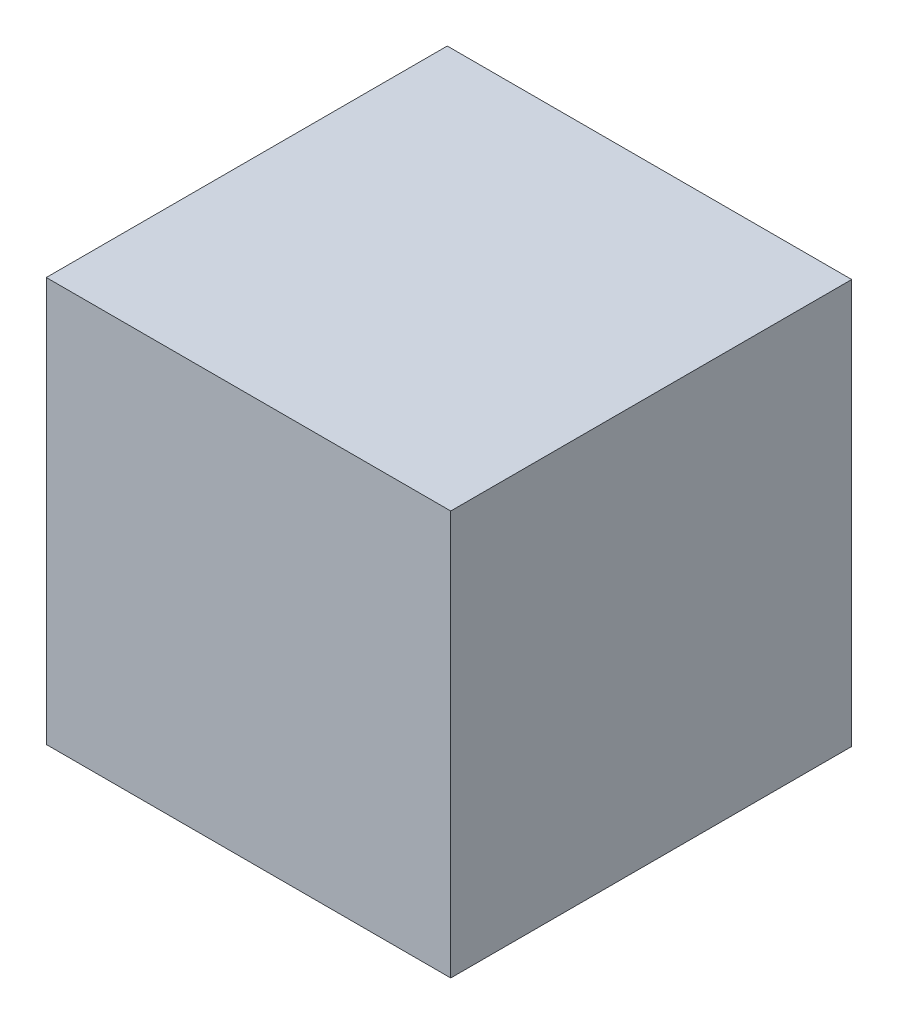
ISO-10303-21;
HEADER;
FILE_DESCRIPTION(('STEP AP214'),'2;1');
FILE_NAME('part.step','',(''),(''),'','','');
FILE_SCHEMA(('AUTOMOTIVE_DESIGN { 1 0 10303 214 1 1 1 1 }'));
ENDSEC;
DATA;
#1=APPLICATION_CONTEXT('core data for automotive mechanical design processes');
#2=APPLICATION_PROTOCOL_DEFINITION('international standard','automotive_design',2000,#1);
#3=PRODUCT_CONTEXT('',#1,'mechanical');
#4=PRODUCT('Part','Part','',(#3));
#5=PRODUCT_RELATED_PRODUCT_CATEGORY('part','',(#4));
#6=PRODUCT_DEFINITION_FORMATION('','',#4);
#7=PRODUCT_DEFINITION_CONTEXT('part definition',#1,'design');
#8=PRODUCT_DEFINITION('design','',#6,#7);
#9=PRODUCT_DEFINITION_SHAPE('','',#8);
#10=(LENGTH_UNIT() NAMED_UNIT(*) SI_UNIT(.MILLI.,.METRE.));
#11=(NAMED_UNIT(*) PLANE_ANGLE_UNIT() SI_UNIT($,.RADIAN.));
#12=(NAMED_UNIT(*) SI_UNIT($,.STERADIAN.) SOLID_ANGLE_UNIT());
#13=UNCERTAINTY_MEASURE_WITH_UNIT(LENGTH_MEASURE(1.E-05),#10,'distance_accuracy_value','');
#14=(GEOMETRIC_REPRESENTATION_CONTEXT(3) GLOBAL_UNCERTAINTY_ASSIGNED_CONTEXT((#13)) GLOBAL_UNIT_ASSIGNED_CONTEXT((#10,
#11,#12)) REPRESENTATION_CONTEXT('',''));
#15=CARTESIAN_POINT('',(0.,0.,0.));
#16=DIRECTION('',(0.,0.,1.));
#17=DIRECTION('',(1.,0.,0.));
#18=AXIS2_PLACEMENT_3D('',#15,#16,#17);
#19=CARTESIAN_POINT('',(-66.2829399141631,51.5772532188841,115.));
#20=DIRECTION('',(1.,0.,0.));
#21=DIRECTION('',(0.,0.,-1.));
#22=AXIS2_PLACEMENT_3D('',#19,#20,#21);
#23=PLANE('',#22);
#24=DIRECTION('',(0.,-1.,0.));
#25=VECTOR('',#24,1.);
#26=CARTESIAN_POINT('',(-66.2829399141631,51.5772532188841,0.));
#27=LINE('',#26,#25);
#28=CARTESIAN_POINT('',(-66.2829399141631,51.5772532188841,0.));
#29=VERTEX_POINT('',#28);
#30=CARTESIAN_POINT('',(-66.2829399141631,-64.4227467811159,0.));
#31=VERTEX_POINT('',#30);
#32=EDGE_CURVE('E96',#29,#31,#27,.T.);
#33=ORIENTED_EDGE('',*,*,#32,.T.);
#34=DIRECTION('',(0.,0.,-1.));
#35=VECTOR('',#34,1.);
#36=CARTESIAN_POINT('',(-66.2829399141631,-64.4227467811159,115.));
#37=LINE('',#36,#35);
#38=CARTESIAN_POINT('',(-66.2829399141631,-64.4227467811159,115.));
#39=VERTEX_POINT('',#38);
#40=EDGE_CURVE('E11',#39,#31,#37,.T.);
#41=ORIENTED_EDGE('',*,*,#40,.F.);
#42=DIRECTION('',(0.,-1.,0.));
#43=VECTOR('',#42,1.);
#44=CARTESIAN_POINT('',(-66.2829399141631,51.5772532188841,115.));
#45=LINE('',#44,#43);
#46=CARTESIAN_POINT('',(-66.2829399141631,51.5772532188841,115.));
#47=VERTEX_POINT('',#46);
#48=EDGE_CURVE('E84',#47,#39,#45,.T.);
#49=ORIENTED_EDGE('',*,*,#48,.F.);
#50=DIRECTION('',(0.,0.,-1.));
#51=VECTOR('',#50,1.);
#52=CARTESIAN_POINT('',(-66.2829399141631,51.5772532188841,115.));
#53=LINE('',#52,#51);
#54=EDGE_CURVE('E92',#47,#29,#53,.T.);
#55=ORIENTED_EDGE('',*,*,#54,.T.);
#56=EDGE_LOOP('',(#33,#41,#49,#55));
#57=FACE_BOUND('',#56,.T.);
#58=ADVANCED_FACE('F33',(#57),#23,.F.);
#59=CARTESIAN_POINT('',(-66.2829399141631,-64.4227467811159,115.));
#60=DIRECTION('',(0.,1.,0.));
#61=DIRECTION('',(0.,0.,1.));
#62=AXIS2_PLACEMENT_3D('',#59,#60,#61);
#63=PLANE('',#62);
#64=DIRECTION('',(1.,0.,0.));
#65=VECTOR('',#64,1.);
#66=CARTESIAN_POINT('',(-66.2829399141631,-64.4227467811159,0.));
#67=LINE('',#66,#65);
#68=CARTESIAN_POINT('',(49.7170600858369,-64.4227467811159,0.));
#69=VERTEX_POINT('',#68);
#70=EDGE_CURVE('E88',#31,#69,#67,.T.);
#71=ORIENTED_EDGE('',*,*,#70,.T.);
#72=DIRECTION('',(0.,0.,-1.));
#73=VECTOR('',#72,1.);
#74=CARTESIAN_POINT('',(49.7170600858369,-64.4227467811159,115.));
#75=LINE('',#74,#73);
#76=CARTESIAN_POINT('',(49.7170600858369,-64.4227467811159,115.));
#77=VERTEX_POINT('',#76);
#78=EDGE_CURVE('E41',#77,#69,#75,.T.);
#79=ORIENTED_EDGE('',*,*,#78,.F.);
#80=DIRECTION('',(1.,0.,0.));
#81=VECTOR('',#80,1.);
#82=CARTESIAN_POINT('',(-66.2829399141631,-64.4227467811159,115.));
#83=LINE('',#82,#81);
#84=EDGE_CURVE('E79',#39,#77,#83,.T.);
#85=ORIENTED_EDGE('',*,*,#84,.F.);
#86=ORIENTED_EDGE('',*,*,#40,.T.);
#87=EDGE_LOOP('',(#71,#79,#85,#86));
#88=FACE_BOUND('',#87,.T.);
#89=ADVANCED_FACE('F87',(#88),#63,.F.);
#90=CARTESIAN_POINT('',(49.7170600858369,51.5772532188841,115.));
#91=DIRECTION('',(-1.,0.,0.));
#92=DIRECTION('',(0.,-1.,0.));
#93=AXIS2_PLACEMENT_3D('',#90,#91,#92);
#94=PLANE('',#93);
#95=DIRECTION('',(0.,1.,0.));
#96=VECTOR('',#95,1.);
#97=CARTESIAN_POINT('',(49.7170600858369,51.5772532188841,0.));
#98=LINE('',#97,#96);
#99=CARTESIAN_POINT('',(49.7170600858369,51.5772532188841,0.));
#100=VERTEX_POINT('',#99);
#101=EDGE_CURVE('E66',#69,#100,#98,.T.);
#102=ORIENTED_EDGE('',*,*,#101,.T.);
#103=DIRECTION('',(0.,0.,-1.));
#104=VECTOR('',#103,1.);
#105=CARTESIAN_POINT('',(49.7170600858369,51.5772532188841,115.));
#106=LINE('',#105,#104);
#107=CARTESIAN_POINT('',(49.7170600858369,51.5772532188841,115.));
#108=VERTEX_POINT('',#107);
#109=EDGE_CURVE('E89',#108,#100,#106,.T.);
#110=ORIENTED_EDGE('',*,*,#109,.F.);
#111=DIRECTION('',(0.,1.,0.));
#112=VECTOR('',#111,1.);
#113=CARTESIAN_POINT('',(49.7170600858369,51.5772532188841,115.));
#114=LINE('',#113,#112);
#115=EDGE_CURVE('E82',#77,#108,#114,.T.);
#116=ORIENTED_EDGE('',*,*,#115,.F.);
#117=ORIENTED_EDGE('',*,*,#78,.T.);
#118=EDGE_LOOP('',(#102,#110,#116,#117));
#119=FACE_BOUND('',#118,.T.);
#120=ADVANCED_FACE('F90',(#119),#94,.F.);
#121=CARTESIAN_POINT('',(-66.2829399141631,51.5772532188841,115.));
#122=DIRECTION('',(0.,-1.,0.));
#123=DIRECTION('',(0.,0.,-1.));
#124=AXIS2_PLACEMENT_3D('',#121,#122,#123);
#125=PLANE('',#124);
#126=DIRECTION('',(-1.,0.,0.));
#127=VECTOR('',#126,1.);
#128=CARTESIAN_POINT('',(-66.2829399141631,51.5772532188841,0.));
#129=LINE('',#128,#127);
#130=EDGE_CURVE('E72',#100,#29,#129,.T.);
#131=ORIENTED_EDGE('',*,*,#130,.T.);
#132=ORIENTED_EDGE('',*,*,#54,.F.);
#133=DIRECTION('',(-1.,0.,0.));
#134=VECTOR('',#133,1.);
#135=CARTESIAN_POINT('',(-66.2829399141631,51.5772532188841,115.));
#136=LINE('',#135,#134);
#137=EDGE_CURVE('E49',#108,#47,#136,.T.);
#138=ORIENTED_EDGE('',*,*,#137,.F.);
#139=ORIENTED_EDGE('',*,*,#109,.T.);
#140=EDGE_LOOP('',(#131,#132,#138,#139));
#141=FACE_BOUND('',#140,.T.);
#142=ADVANCED_FACE('F103',(#141),#125,.F.);
#143=CARTESIAN_POINT('',(0.,0.,115.));
#144=DIRECTION('',(0.,0.,1.));
#145=DIRECTION('',(1.,0.,0.));
#146=AXIS2_PLACEMENT_3D('',#143,#144,#145);
#147=PLANE('',#146);
#148=ORIENTED_EDGE('',*,*,#48,.T.);
#149=ORIENTED_EDGE('',*,*,#84,.T.);
#150=ORIENTED_EDGE('',*,*,#115,.T.);
#151=ORIENTED_EDGE('',*,*,#137,.T.);
#152=EDGE_LOOP('',(#148,#149,#150,#151));
#153=FACE_BOUND('',#152,.T.);
#154=ADVANCED_FACE('F80',(#153),#147,.T.);
#155=CARTESIAN_POINT('',(0.,0.,0.));
#156=DIRECTION('',(0.,0.,1.));
#157=DIRECTION('',(1.,0.,0.));
#158=AXIS2_PLACEMENT_3D('',#155,#156,#157);
#159=PLANE('',#158);
#160=ORIENTED_EDGE('',*,*,#32,.F.);
#161=ORIENTED_EDGE('',*,*,#130,.F.);
#162=ORIENTED_EDGE('',*,*,#101,.F.);
#163=ORIENTED_EDGE('',*,*,#70,.F.);
#164=EDGE_LOOP('',(#160,#161,#162,#163));
#165=FACE_BOUND('',#164,.T.);
#166=ADVANCED_FACE('F106',(#165),#159,.F.);
#167=CLOSED_SHELL('',(#58,#89,#120,#142,#154,#166));
#168=MANIFOLD_SOLID_BREP('B2',#167);
#169=ADVANCED_BREP_SHAPE_REPRESENTATION('',(#18,#168),#14);
#170=SHAPE_DEFINITION_REPRESENTATION(#9,#169);
ENDSEC;
END-ISO-10303-21;
